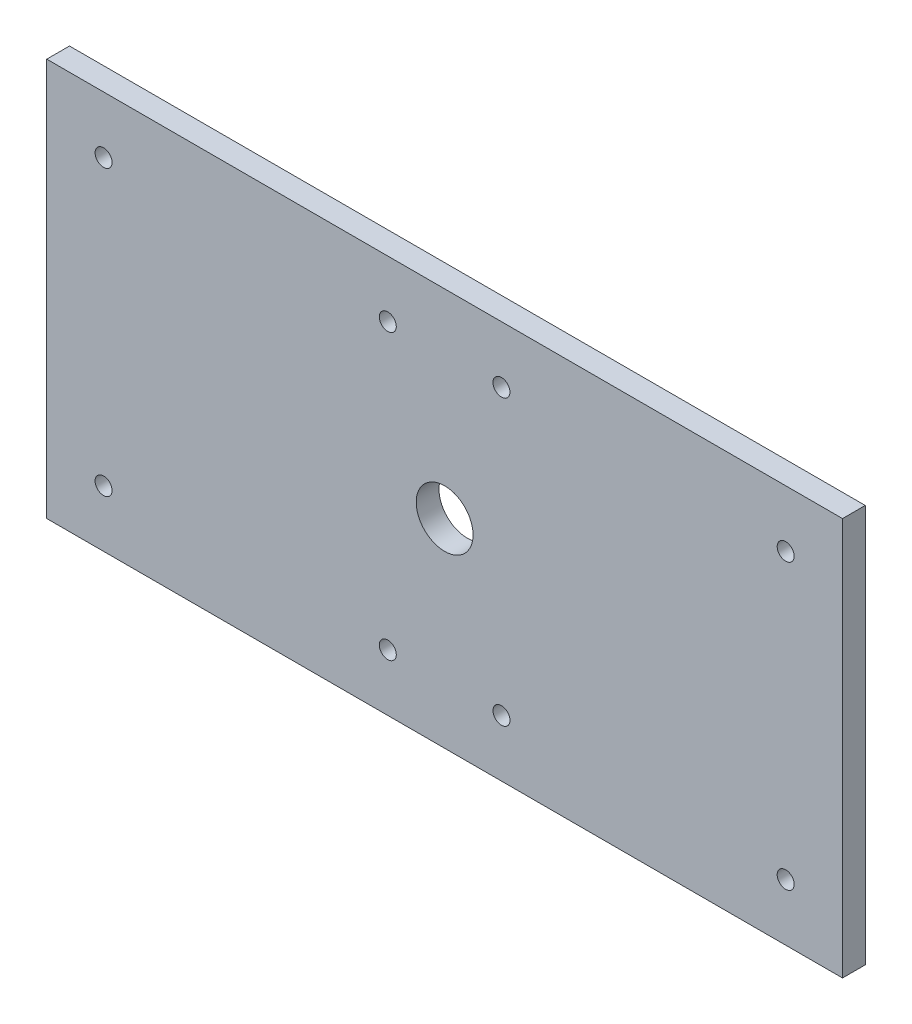
ISO-10303-21;
HEADER;
FILE_DESCRIPTION(('STEP AP214'),'2;1');
FILE_NAME('part.step','',(''),(''),'','','');
FILE_SCHEMA(('AUTOMOTIVE_DESIGN { 1 0 10303 214 1 1 1 1 }'));
ENDSEC;
DATA;
#1=APPLICATION_CONTEXT('core data for automotive mechanical design processes');
#2=APPLICATION_PROTOCOL_DEFINITION('international standard','automotive_design',2000,#1);
#3=PRODUCT_CONTEXT('',#1,'mechanical');
#4=PRODUCT('Part','Part','',(#3));
#5=PRODUCT_RELATED_PRODUCT_CATEGORY('part','',(#4));
#6=PRODUCT_DEFINITION_FORMATION('','',#4);
#7=PRODUCT_DEFINITION_CONTEXT('part definition',#1,'design');
#8=PRODUCT_DEFINITION('design','',#6,#7);
#9=PRODUCT_DEFINITION_SHAPE('','',#8);
#10=(LENGTH_UNIT() NAMED_UNIT(*) SI_UNIT(.MILLI.,.METRE.));
#11=(NAMED_UNIT(*) PLANE_ANGLE_UNIT() SI_UNIT($,.RADIAN.));
#12=(NAMED_UNIT(*) SI_UNIT($,.STERADIAN.) SOLID_ANGLE_UNIT());
#13=UNCERTAINTY_MEASURE_WITH_UNIT(LENGTH_MEASURE(1.E-05),#10,'distance_accuracy_value','');
#14=(GEOMETRIC_REPRESENTATION_CONTEXT(3) GLOBAL_UNCERTAINTY_ASSIGNED_CONTEXT((#13)) GLOBAL_UNIT_ASSIGNED_CONTEXT((#10,
#11,#12)) REPRESENTATION_CONTEXT('',''));
#15=CARTESIAN_POINT('',(0.,0.,0.));
#16=DIRECTION('',(0.,0.,1.));
#17=DIRECTION('',(1.,0.,0.));
#18=AXIS2_PLACEMENT_3D('',#15,#16,#17);
#19=CARTESIAN_POINT('',(0.,0.,5.08));
#20=DIRECTION('',(0.,0.,1.));
#21=DIRECTION('',(1.,0.,0.));
#22=AXIS2_PLACEMENT_3D('',#19,#20,#21);
#23=PLANE('',#22);
#24=CARTESIAN_POINT('',(76.2,-31.75,5.08));
#25=DIRECTION('',(0.,0.,1.));
#26=DIRECTION('',(1.,0.,0.));
#27=AXIS2_PLACEMENT_3D('',#24,#25,#26);
#28=CIRCLE('',#27,1.89865);
#29=CARTESIAN_POINT('',(78.09865,-31.75,5.08));
#30=VERTEX_POINT('',#29);
#31=EDGE_CURVE('E162',#30,#30,#28,.T.);
#32=ORIENTED_EDGE('',*,*,#31,.F.);
#33=EDGE_LOOP('',(#32));
#34=FACE_BOUND('',#33,.T.);
#35=CARTESIAN_POINT('',(-76.2,31.75,5.08));
#36=DIRECTION('',(0.,0.,1.));
#37=DIRECTION('',(1.,0.,0.));
#38=AXIS2_PLACEMENT_3D('',#35,#36,#37);
#39=CIRCLE('',#38,1.89865);
#40=CARTESIAN_POINT('',(-74.30135,31.75,5.08));
#41=VERTEX_POINT('',#40);
#42=EDGE_CURVE('E156',#41,#41,#39,.T.);
#43=ORIENTED_EDGE('',*,*,#42,.F.);
#44=EDGE_LOOP('',(#43));
#45=FACE_BOUND('',#44,.T.);
#46=CARTESIAN_POINT('',(-76.2,-31.75,5.08));
#47=DIRECTION('',(0.,0.,1.));
#48=DIRECTION('',(1.,0.,0.));
#49=AXIS2_PLACEMENT_3D('',#46,#47,#48);
#50=CIRCLE('',#49,1.89865);
#51=CARTESIAN_POINT('',(-74.30135,-31.75,5.08));
#52=VERTEX_POINT('',#51);
#53=EDGE_CURVE('E150',#52,#52,#50,.T.);
#54=ORIENTED_EDGE('',*,*,#53,.F.);
#55=EDGE_LOOP('',(#54));
#56=FACE_BOUND('',#55,.T.);
#57=CARTESIAN_POINT('',(76.2,31.75,5.08));
#58=DIRECTION('',(0.,0.,1.));
#59=DIRECTION('',(1.,0.,0.));
#60=AXIS2_PLACEMENT_3D('',#57,#58,#59);
#61=CIRCLE('',#60,1.89865);
#62=CARTESIAN_POINT('',(78.09865,31.75,5.08));
#63=VERTEX_POINT('',#62);
#64=EDGE_CURVE('E144',#63,#63,#61,.T.);
#65=ORIENTED_EDGE('',*,*,#64,.F.);
#66=EDGE_LOOP('',(#65));
#67=FACE_BOUND('',#66,.T.);
#68=CARTESIAN_POINT('',(12.7,-31.75,5.08));
#69=DIRECTION('',(0.,0.,1.));
#70=DIRECTION('',(1.,0.,0.));
#71=AXIS2_PLACEMENT_3D('',#68,#69,#70);
#72=CIRCLE('',#71,1.89865);
#73=CARTESIAN_POINT('',(14.59865,-31.75,5.08));
#74=VERTEX_POINT('',#73);
#75=EDGE_CURVE('E138',#74,#74,#72,.T.);
#76=ORIENTED_EDGE('',*,*,#75,.F.);
#77=EDGE_LOOP('',(#76));
#78=FACE_BOUND('',#77,.T.);
#79=CARTESIAN_POINT('',(-12.7,31.75,5.08));
#80=DIRECTION('',(0.,0.,1.));
#81=DIRECTION('',(1.,0.,0.));
#82=AXIS2_PLACEMENT_3D('',#79,#80,#81);
#83=CIRCLE('',#82,1.89865);
#84=CARTESIAN_POINT('',(-10.80135,31.75,5.08));
#85=VERTEX_POINT('',#84);
#86=EDGE_CURVE('E132',#85,#85,#83,.T.);
#87=ORIENTED_EDGE('',*,*,#86,.F.);
#88=EDGE_LOOP('',(#87));
#89=FACE_BOUND('',#88,.T.);
#90=CARTESIAN_POINT('',(-12.7,-31.75,5.08));
#91=DIRECTION('',(0.,0.,1.));
#92=DIRECTION('',(1.,0.,0.));
#93=AXIS2_PLACEMENT_3D('',#90,#91,#92);
#94=CIRCLE('',#93,1.89865);
#95=CARTESIAN_POINT('',(-10.80135,-31.75,5.08));
#96=VERTEX_POINT('',#95);
#97=EDGE_CURVE('E126',#96,#96,#94,.T.);
#98=ORIENTED_EDGE('',*,*,#97,.F.);
#99=EDGE_LOOP('',(#98));
#100=FACE_BOUND('',#99,.T.);
#101=CARTESIAN_POINT('',(12.7,31.75,5.08));
#102=DIRECTION('',(0.,0.,1.));
#103=DIRECTION('',(1.,0.,0.));
#104=AXIS2_PLACEMENT_3D('',#101,#102,#103);
#105=CIRCLE('',#104,1.89865);
#106=CARTESIAN_POINT('',(14.59865,31.75,5.08));
#107=VERTEX_POINT('',#106);
#108=EDGE_CURVE('E120',#107,#107,#105,.T.);
#109=ORIENTED_EDGE('',*,*,#108,.F.);
#110=EDGE_LOOP('',(#109));
#111=FACE_BOUND('',#110,.T.);
#112=DIRECTION('',(0.,1.,0.));
#113=VECTOR('',#112,1.);
#114=CARTESIAN_POINT('',(88.9,44.45,5.08));
#115=LINE('',#114,#113);
#116=CARTESIAN_POINT('',(88.9,-44.45,5.08));
#117=VERTEX_POINT('',#116);
#118=CARTESIAN_POINT('',(88.9,44.45,5.08));
#119=VERTEX_POINT('',#118);
#120=EDGE_CURVE('E85',#117,#119,#115,.T.);
#121=ORIENTED_EDGE('',*,*,#120,.T.);
#122=DIRECTION('',(-1.,0.,0.));
#123=VECTOR('',#122,1.);
#124=CARTESIAN_POINT('',(-88.9,44.45,5.08));
#125=LINE('',#124,#123);
#126=CARTESIAN_POINT('',(-88.9,44.45,5.08));
#127=VERTEX_POINT('',#126);
#128=EDGE_CURVE('E80',#119,#127,#125,.T.);
#129=ORIENTED_EDGE('',*,*,#128,.T.);
#130=DIRECTION('',(0.,-1.,0.));
#131=VECTOR('',#130,1.);
#132=CARTESIAN_POINT('',(-88.9,44.45,5.08));
#133=LINE('',#132,#131);
#134=CARTESIAN_POINT('',(-88.9,-44.45,5.08));
#135=VERTEX_POINT('',#134);
#136=EDGE_CURVE('E83',#127,#135,#133,.T.);
#137=ORIENTED_EDGE('',*,*,#136,.T.);
#138=DIRECTION('',(1.,0.,0.));
#139=VECTOR('',#138,1.);
#140=CARTESIAN_POINT('',(-88.9,-44.45,5.08));
#141=LINE('',#140,#139);
#142=EDGE_CURVE('E50',#135,#117,#141,.T.);
#143=ORIENTED_EDGE('',*,*,#142,.T.);
#144=EDGE_LOOP('',(#121,#129,#137,#143));
#145=FACE_BOUND('',#144,.T.);
#146=CARTESIAN_POINT('',(0.,0.,5.08));
#147=DIRECTION('',(0.,0.,1.));
#148=DIRECTION('',(1.,0.,0.));
#149=AXIS2_PLACEMENT_3D('',#146,#147,#148);
#150=CIRCLE('',#149,6.35);
#151=CARTESIAN_POINT('',(6.34999999999997,0.,5.08));
#152=VERTEX_POINT('',#151);
#153=EDGE_CURVE('E100',#152,#152,#150,.T.);
#154=ORIENTED_EDGE('',*,*,#153,.F.);
#155=EDGE_LOOP('',(#154));
#156=FACE_BOUND('',#155,.T.);
#157=ADVANCED_FACE('F33',(#34,#45,#56,#67,#78,#89,#100,#111,#145,#156),#23,.T.);
#158=CARTESIAN_POINT('',(0.,0.,0.));
#159=DIRECTION('',(0.,0.,1.));
#160=DIRECTION('',(1.,0.,0.));
#161=AXIS2_PLACEMENT_3D('',#158,#159,#160);
#162=PLANE('',#161);
#163=CARTESIAN_POINT('',(76.2,-31.75,0.));
#164=DIRECTION('',(0.,0.,1.));
#165=DIRECTION('',(1.,0.,0.));
#166=AXIS2_PLACEMENT_3D('',#163,#164,#165);
#167=CIRCLE('',#166,1.89865);
#168=CARTESIAN_POINT('',(78.09865,-31.75,0.));
#169=VERTEX_POINT('',#168);
#170=EDGE_CURVE('E159',#169,#169,#167,.T.);
#171=ORIENTED_EDGE('',*,*,#170,.T.);
#172=EDGE_LOOP('',(#171));
#173=FACE_BOUND('',#172,.T.);
#174=CARTESIAN_POINT('',(-76.2,31.75,0.));
#175=DIRECTION('',(0.,0.,1.));
#176=DIRECTION('',(1.,0.,0.));
#177=AXIS2_PLACEMENT_3D('',#174,#175,#176);
#178=CIRCLE('',#177,1.89865);
#179=CARTESIAN_POINT('',(-74.30135,31.75,0.));
#180=VERTEX_POINT('',#179);
#181=EDGE_CURVE('E153',#180,#180,#178,.T.);
#182=ORIENTED_EDGE('',*,*,#181,.T.);
#183=EDGE_LOOP('',(#182));
#184=FACE_BOUND('',#183,.T.);
#185=CARTESIAN_POINT('',(-76.2,-31.75,0.));
#186=DIRECTION('',(0.,0.,1.));
#187=DIRECTION('',(1.,0.,0.));
#188=AXIS2_PLACEMENT_3D('',#185,#186,#187);
#189=CIRCLE('',#188,1.89865);
#190=CARTESIAN_POINT('',(-74.30135,-31.75,0.));
#191=VERTEX_POINT('',#190);
#192=EDGE_CURVE('E147',#191,#191,#189,.T.);
#193=ORIENTED_EDGE('',*,*,#192,.T.);
#194=EDGE_LOOP('',(#193));
#195=FACE_BOUND('',#194,.T.);
#196=CARTESIAN_POINT('',(76.2,31.75,0.));
#197=DIRECTION('',(0.,0.,1.));
#198=DIRECTION('',(1.,0.,0.));
#199=AXIS2_PLACEMENT_3D('',#196,#197,#198);
#200=CIRCLE('',#199,1.89865);
#201=CARTESIAN_POINT('',(78.09865,31.75,0.));
#202=VERTEX_POINT('',#201);
#203=EDGE_CURVE('E141',#202,#202,#200,.T.);
#204=ORIENTED_EDGE('',*,*,#203,.T.);
#205=EDGE_LOOP('',(#204));
#206=FACE_BOUND('',#205,.T.);
#207=CARTESIAN_POINT('',(12.7,-31.75,0.));
#208=DIRECTION('',(0.,0.,1.));
#209=DIRECTION('',(1.,0.,0.));
#210=AXIS2_PLACEMENT_3D('',#207,#208,#209);
#211=CIRCLE('',#210,1.89865);
#212=CARTESIAN_POINT('',(14.59865,-31.75,0.));
#213=VERTEX_POINT('',#212);
#214=EDGE_CURVE('E135',#213,#213,#211,.T.);
#215=ORIENTED_EDGE('',*,*,#214,.T.);
#216=EDGE_LOOP('',(#215));
#217=FACE_BOUND('',#216,.T.);
#218=CARTESIAN_POINT('',(-12.7,31.75,0.));
#219=DIRECTION('',(0.,0.,1.));
#220=DIRECTION('',(1.,0.,0.));
#221=AXIS2_PLACEMENT_3D('',#218,#219,#220);
#222=CIRCLE('',#221,1.89865);
#223=CARTESIAN_POINT('',(-10.80135,31.75,0.));
#224=VERTEX_POINT('',#223);
#225=EDGE_CURVE('E129',#224,#224,#222,.T.);
#226=ORIENTED_EDGE('',*,*,#225,.T.);
#227=EDGE_LOOP('',(#226));
#228=FACE_BOUND('',#227,.T.);
#229=CARTESIAN_POINT('',(-12.7,-31.75,0.));
#230=DIRECTION('',(0.,0.,1.));
#231=DIRECTION('',(1.,0.,0.));
#232=AXIS2_PLACEMENT_3D('',#229,#230,#231);
#233=CIRCLE('',#232,1.89865);
#234=CARTESIAN_POINT('',(-10.80135,-31.75,0.));
#235=VERTEX_POINT('',#234);
#236=EDGE_CURVE('E123',#235,#235,#233,.T.);
#237=ORIENTED_EDGE('',*,*,#236,.T.);
#238=EDGE_LOOP('',(#237));
#239=FACE_BOUND('',#238,.T.);
#240=CARTESIAN_POINT('',(12.7,31.75,0.));
#241=DIRECTION('',(0.,0.,1.));
#242=DIRECTION('',(1.,0.,0.));
#243=AXIS2_PLACEMENT_3D('',#240,#241,#242);
#244=CIRCLE('',#243,1.89865);
#245=CARTESIAN_POINT('',(14.59865,31.75,0.));
#246=VERTEX_POINT('',#245);
#247=EDGE_CURVE('E115',#246,#246,#244,.T.);
#248=ORIENTED_EDGE('',*,*,#247,.T.);
#249=EDGE_LOOP('',(#248));
#250=FACE_BOUND('',#249,.T.);
#251=DIRECTION('',(0.,1.,0.));
#252=VECTOR('',#251,1.);
#253=CARTESIAN_POINT('',(88.9,44.45,0.));
#254=LINE('',#253,#252);
#255=CARTESIAN_POINT('',(88.9,-44.45,0.));
#256=VERTEX_POINT('',#255);
#257=CARTESIAN_POINT('',(88.9,44.45,0.));
#258=VERTEX_POINT('',#257);
#259=EDGE_CURVE('E97',#256,#258,#254,.T.);
#260=ORIENTED_EDGE('',*,*,#259,.F.);
#261=DIRECTION('',(1.,0.,0.));
#262=VECTOR('',#261,1.);
#263=CARTESIAN_POINT('',(-88.9,-44.45,0.));
#264=LINE('',#263,#262);
#265=CARTESIAN_POINT('',(-88.9,-44.45,0.));
#266=VERTEX_POINT('',#265);
#267=EDGE_CURVE('E73',#266,#256,#264,.T.);
#268=ORIENTED_EDGE('',*,*,#267,.F.);
#269=DIRECTION('',(0.,-1.,0.));
#270=VECTOR('',#269,1.);
#271=CARTESIAN_POINT('',(-88.9,44.45,0.));
#272=LINE('',#271,#270);
#273=CARTESIAN_POINT('',(-88.9,44.45,0.));
#274=VERTEX_POINT('',#273);
#275=EDGE_CURVE('E67',#274,#266,#272,.T.);
#276=ORIENTED_EDGE('',*,*,#275,.F.);
#277=DIRECTION('',(-1.,0.,0.));
#278=VECTOR('',#277,1.);
#279=CARTESIAN_POINT('',(-88.9,44.45,0.));
#280=LINE('',#279,#278);
#281=EDGE_CURVE('E89',#258,#274,#280,.T.);
#282=ORIENTED_EDGE('',*,*,#281,.F.);
#283=EDGE_LOOP('',(#260,#268,#276,#282));
#284=FACE_BOUND('',#283,.T.);
#285=CARTESIAN_POINT('',(0.,0.,0.));
#286=DIRECTION('',(0.,0.,1.));
#287=DIRECTION('',(1.,0.,0.));
#288=AXIS2_PLACEMENT_3D('',#285,#286,#287);
#289=CIRCLE('',#288,6.35);
#290=CARTESIAN_POINT('',(6.34999999999997,0.,0.));
#291=VERTEX_POINT('',#290);
#292=EDGE_CURVE('E112',#291,#291,#289,.T.);
#293=ORIENTED_EDGE('',*,*,#292,.T.);
#294=EDGE_LOOP('',(#293));
#295=FACE_BOUND('',#294,.T.);
#296=ADVANCED_FACE('F108',(#173,#184,#195,#206,#217,#228,#239,#250,#284,#295),#162,.F.);
#297=CARTESIAN_POINT('',(88.9,44.45,5.08));
#298=DIRECTION('',(-1.,0.,0.));
#299=DIRECTION('',(0.,0.,1.));
#300=AXIS2_PLACEMENT_3D('',#297,#298,#299);
#301=PLANE('',#300);
#302=ORIENTED_EDGE('',*,*,#259,.T.);
#303=DIRECTION('',(0.,0.,-1.));
#304=VECTOR('',#303,1.);
#305=CARTESIAN_POINT('',(88.9,44.45,5.08));
#306=LINE('',#305,#304);
#307=EDGE_CURVE('E11',#119,#258,#306,.T.);
#308=ORIENTED_EDGE('',*,*,#307,.F.);
#309=ORIENTED_EDGE('',*,*,#120,.F.);
#310=DIRECTION('',(0.,0.,-1.));
#311=VECTOR('',#310,1.);
#312=CARTESIAN_POINT('',(88.9,-44.45,5.08));
#313=LINE('',#312,#311);
#314=EDGE_CURVE('E93',#117,#256,#313,.T.);
#315=ORIENTED_EDGE('',*,*,#314,.T.);
#316=EDGE_LOOP('',(#302,#308,#309,#315));
#317=FACE_BOUND('',#316,.T.);
#318=ADVANCED_FACE('F35',(#317),#301,.F.);
#319=CARTESIAN_POINT('',(-88.9,44.45,5.08));
#320=DIRECTION('',(0.,-1.,0.));
#321=DIRECTION('',(0.,0.,-1.));
#322=AXIS2_PLACEMENT_3D('',#319,#320,#321);
#323=PLANE('',#322);
#324=ORIENTED_EDGE('',*,*,#281,.T.);
#325=DIRECTION('',(0.,0.,-1.));
#326=VECTOR('',#325,1.);
#327=CARTESIAN_POINT('',(-88.9,44.45,5.08));
#328=LINE('',#327,#326);
#329=EDGE_CURVE('E42',#127,#274,#328,.T.);
#330=ORIENTED_EDGE('',*,*,#329,.F.);
#331=ORIENTED_EDGE('',*,*,#128,.F.);
#332=ORIENTED_EDGE('',*,*,#307,.T.);
#333=EDGE_LOOP('',(#324,#330,#331,#332));
#334=FACE_BOUND('',#333,.T.);
#335=ADVANCED_FACE('F88',(#334),#323,.F.);
#336=CARTESIAN_POINT('',(-88.9,44.45,5.08));
#337=DIRECTION('',(1.,0.,0.));
#338=DIRECTION('',(0.,0.,-1.));
#339=AXIS2_PLACEMENT_3D('',#336,#337,#338);
#340=PLANE('',#339);
#341=ORIENTED_EDGE('',*,*,#275,.T.);
#342=DIRECTION('',(0.,0.,-1.));
#343=VECTOR('',#342,1.);
#344=CARTESIAN_POINT('',(-88.9,-44.45,5.08));
#345=LINE('',#344,#343);
#346=EDGE_CURVE('E90',#135,#266,#345,.T.);
#347=ORIENTED_EDGE('',*,*,#346,.F.);
#348=ORIENTED_EDGE('',*,*,#136,.F.);
#349=ORIENTED_EDGE('',*,*,#329,.T.);
#350=EDGE_LOOP('',(#341,#347,#348,#349));
#351=FACE_BOUND('',#350,.T.);
#352=ADVANCED_FACE('F91',(#351),#340,.F.);
#353=CARTESIAN_POINT('',(-88.9,-44.45,5.08));
#354=DIRECTION('',(0.,1.,0.));
#355=DIRECTION('',(0.,0.,1.));
#356=AXIS2_PLACEMENT_3D('',#353,#354,#355);
#357=PLANE('',#356);
#358=ORIENTED_EDGE('',*,*,#267,.T.);
#359=ORIENTED_EDGE('',*,*,#314,.F.);
#360=ORIENTED_EDGE('',*,*,#142,.F.);
#361=ORIENTED_EDGE('',*,*,#346,.T.);
#362=EDGE_LOOP('',(#358,#359,#360,#361));
#363=FACE_BOUND('',#362,.T.);
#364=ADVANCED_FACE('F105',(#363),#357,.F.);
#365=CARTESIAN_POINT('',(0.,0.,5.08));
#366=DIRECTION('',(0.,0.,-1.));
#367=DIRECTION('',(-1.,0.,0.));
#368=AXIS2_PLACEMENT_3D('',#365,#366,#367);
#369=CYLINDRICAL_SURFACE('',#368,6.35);
#370=ORIENTED_EDGE('',*,*,#153,.T.);
#371=EDGE_LOOP('',(#370));
#372=FACE_BOUND('',#371,.T.);
#373=ORIENTED_EDGE('',*,*,#292,.F.);
#374=EDGE_LOOP('',(#373));
#375=FACE_BOUND('',#374,.T.);
#376=ADVANCED_FACE('F188',(#372,#375),#369,.F.);
#377=CARTESIAN_POINT('',(12.7,31.75,5.08));
#378=DIRECTION('',(0.,0.,1.));
#379=DIRECTION('',(1.,0.,0.));
#380=AXIS2_PLACEMENT_3D('',#377,#378,#379);
#381=CYLINDRICAL_SURFACE('',#380,1.89865);
#382=ORIENTED_EDGE('',*,*,#247,.F.);
#383=EDGE_LOOP('',(#382));
#384=FACE_BOUND('',#383,.T.);
#385=ORIENTED_EDGE('',*,*,#108,.T.);
#386=EDGE_LOOP('',(#385));
#387=FACE_BOUND('',#386,.T.);
#388=ADVANCED_FACE('F185',(#384,#387),#381,.F.);
#389=CARTESIAN_POINT('',(-12.7,-31.75,5.08));
#390=DIRECTION('',(0.,0.,1.));
#391=DIRECTION('',(1.,0.,0.));
#392=AXIS2_PLACEMENT_3D('',#389,#390,#391);
#393=CYLINDRICAL_SURFACE('',#392,1.89865);
#394=ORIENTED_EDGE('',*,*,#236,.F.);
#395=EDGE_LOOP('',(#394));
#396=FACE_BOUND('',#395,.T.);
#397=ORIENTED_EDGE('',*,*,#97,.T.);
#398=EDGE_LOOP('',(#397));
#399=FACE_BOUND('',#398,.T.);
#400=ADVANCED_FACE('F187',(#396,#399),#393,.F.);
#401=CARTESIAN_POINT('',(-12.7,31.75,5.08));
#402=DIRECTION('',(0.,0.,1.));
#403=DIRECTION('',(1.,0.,0.));
#404=AXIS2_PLACEMENT_3D('',#401,#402,#403);
#405=CYLINDRICAL_SURFACE('',#404,1.89865);
#406=ORIENTED_EDGE('',*,*,#225,.F.);
#407=EDGE_LOOP('',(#406));
#408=FACE_BOUND('',#407,.T.);
#409=ORIENTED_EDGE('',*,*,#86,.T.);
#410=EDGE_LOOP('',(#409));
#411=FACE_BOUND('',#410,.T.);
#412=ADVANCED_FACE('F195',(#408,#411),#405,.F.);
#413=CARTESIAN_POINT('',(12.7,-31.75,5.08));
#414=DIRECTION('',(0.,0.,1.));
#415=DIRECTION('',(1.,0.,0.));
#416=AXIS2_PLACEMENT_3D('',#413,#414,#415);
#417=CYLINDRICAL_SURFACE('',#416,1.89865);
#418=ORIENTED_EDGE('',*,*,#214,.F.);
#419=EDGE_LOOP('',(#418));
#420=FACE_BOUND('',#419,.T.);
#421=ORIENTED_EDGE('',*,*,#75,.T.);
#422=EDGE_LOOP('',(#421));
#423=FACE_BOUND('',#422,.T.);
#424=ADVANCED_FACE('F268',(#420,#423),#417,.F.);
#425=CARTESIAN_POINT('',(76.2,31.75,5.08));
#426=DIRECTION('',(0.,0.,1.));
#427=DIRECTION('',(1.,0.,0.));
#428=AXIS2_PLACEMENT_3D('',#425,#426,#427);
#429=CYLINDRICAL_SURFACE('',#428,1.89865);
#430=ORIENTED_EDGE('',*,*,#203,.F.);
#431=EDGE_LOOP('',(#430));
#432=FACE_BOUND('',#431,.T.);
#433=ORIENTED_EDGE('',*,*,#64,.T.);
#434=EDGE_LOOP('',(#433));
#435=FACE_BOUND('',#434,.T.);
#436=ADVANCED_FACE('F276',(#432,#435),#429,.F.);
#437=CARTESIAN_POINT('',(-76.2,-31.75,5.08));
#438=DIRECTION('',(0.,0.,1.));
#439=DIRECTION('',(1.,0.,0.));
#440=AXIS2_PLACEMENT_3D('',#437,#438,#439);
#441=CYLINDRICAL_SURFACE('',#440,1.89865);
#442=ORIENTED_EDGE('',*,*,#192,.F.);
#443=EDGE_LOOP('',(#442));
#444=FACE_BOUND('',#443,.T.);
#445=ORIENTED_EDGE('',*,*,#53,.T.);
#446=EDGE_LOOP('',(#445));
#447=FACE_BOUND('',#446,.T.);
#448=ADVANCED_FACE('F285',(#444,#447),#441,.F.);
#449=CARTESIAN_POINT('',(-76.2,31.75,5.08));
#450=DIRECTION('',(0.,0.,1.));
#451=DIRECTION('',(1.,0.,0.));
#452=AXIS2_PLACEMENT_3D('',#449,#450,#451);
#453=CYLINDRICAL_SURFACE('',#452,1.89865);
#454=ORIENTED_EDGE('',*,*,#181,.F.);
#455=EDGE_LOOP('',(#454));
#456=FACE_BOUND('',#455,.T.);
#457=ORIENTED_EDGE('',*,*,#42,.T.);
#458=EDGE_LOOP('',(#457));
#459=FACE_BOUND('',#458,.T.);
#460=ADVANCED_FACE('F294',(#456,#459),#453,.F.);
#461=CARTESIAN_POINT('',(76.2,-31.75,5.08));
#462=DIRECTION('',(0.,0.,1.));
#463=DIRECTION('',(1.,0.,0.));
#464=AXIS2_PLACEMENT_3D('',#461,#462,#463);
#465=CYLINDRICAL_SURFACE('',#464,1.89865);
#466=ORIENTED_EDGE('',*,*,#170,.F.);
#467=EDGE_LOOP('',(#466));
#468=FACE_BOUND('',#467,.T.);
#469=ORIENTED_EDGE('',*,*,#31,.T.);
#470=EDGE_LOOP('',(#469));
#471=FACE_BOUND('',#470,.T.);
#472=ADVANCED_FACE('F166',(#468,#471),#465,.F.);
#473=CLOSED_SHELL('',(#157,#296,#318,#335,#352,#364,#376,#388,#400,#412,#424,#436,#448,#460,#472));
#474=MANIFOLD_SOLID_BREP('B2',#473);
#475=ADVANCED_BREP_SHAPE_REPRESENTATION('',(#18,#474),#14);
#476=SHAPE_DEFINITION_REPRESENTATION(#9,#475);
ENDSEC;
END-ISO-10303-21;
